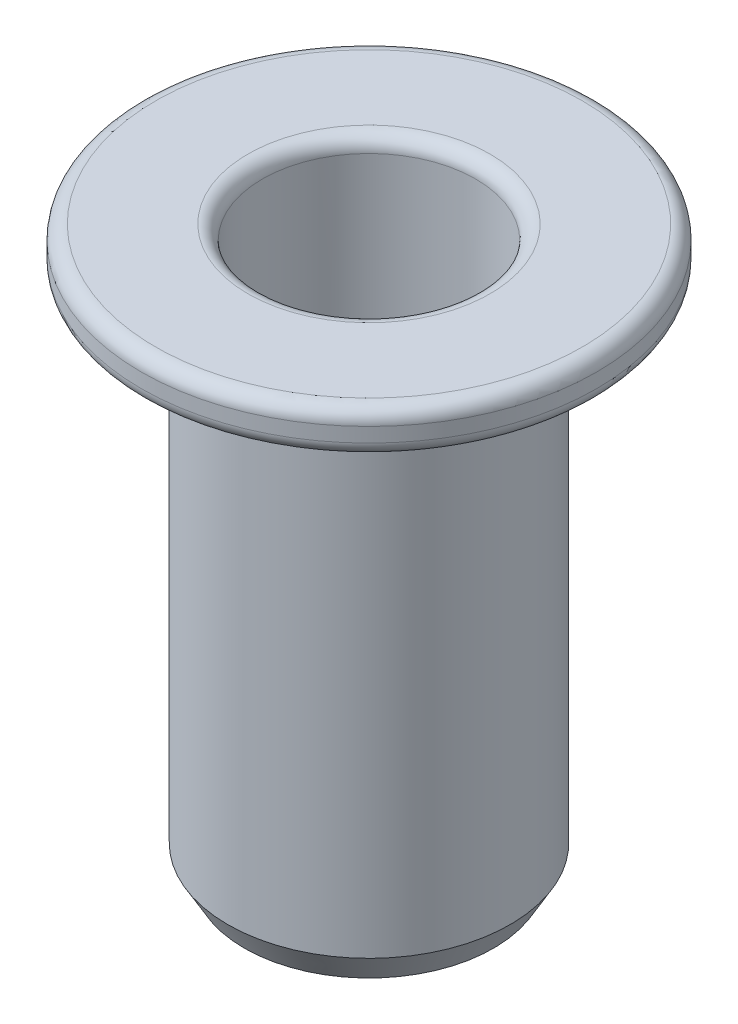
ISO-10303-21;
HEADER;
FILE_DESCRIPTION(('STEP AP214'),'2;1');
FILE_NAME('part.step','',(''),(''),'','','');
FILE_SCHEMA(('AUTOMOTIVE_DESIGN { 1 0 10303 214 1 1 1 1 }'));
ENDSEC;
DATA;
#1=APPLICATION_CONTEXT('core data for automotive mechanical design processes');
#2=APPLICATION_PROTOCOL_DEFINITION('international standard','automotive_design',2000,#1);
#3=PRODUCT_CONTEXT('',#1,'mechanical');
#4=PRODUCT('Part','Part','',(#3));
#5=PRODUCT_RELATED_PRODUCT_CATEGORY('part','',(#4));
#6=PRODUCT_DEFINITION_FORMATION('','',#4);
#7=PRODUCT_DEFINITION_CONTEXT('part definition',#1,'design');
#8=PRODUCT_DEFINITION('design','',#6,#7);
#9=PRODUCT_DEFINITION_SHAPE('','',#8);
#10=(LENGTH_UNIT() NAMED_UNIT(*) SI_UNIT(.MILLI.,.METRE.));
#11=(NAMED_UNIT(*) PLANE_ANGLE_UNIT() SI_UNIT($,.RADIAN.));
#12=(NAMED_UNIT(*) SI_UNIT($,.STERADIAN.) SOLID_ANGLE_UNIT());
#13=UNCERTAINTY_MEASURE_WITH_UNIT(LENGTH_MEASURE(1.E-05),#10,'distance_accuracy_value','');
#14=(GEOMETRIC_REPRESENTATION_CONTEXT(3) GLOBAL_UNCERTAINTY_ASSIGNED_CONTEXT((#13)) GLOBAL_UNIT_ASSIGNED_CONTEXT((#10,
#11,#12)) REPRESENTATION_CONTEXT('',''));
#15=CARTESIAN_POINT('',(0.,0.,0.));
#16=DIRECTION('',(0.,0.,1.));
#17=DIRECTION('',(1.,0.,0.));
#18=AXIS2_PLACEMENT_3D('',#15,#16,#17);
#19=CARTESIAN_POINT('',(3.95,0.,0.));
#20=DIRECTION('',(0.,-1.,0.));
#21=DIRECTION('',(0.,0.,-1.));
#22=AXIS2_PLACEMENT_3D('',#19,#20,#21);
#23=PLANE('',#22);
#24=CARTESIAN_POINT('',(0.,0.,0.));
#25=DIRECTION('',(0.,-1.,0.));
#26=DIRECTION('',(0.,0.,-1.));
#27=AXIS2_PLACEMENT_3D('',#24,#25,#26);
#28=CIRCLE('',#27,3.7);
#29=CARTESIAN_POINT('',(0.,0.,-3.7));
#30=VERTEX_POINT('',#29);
#31=EDGE_CURVE('E55',#30,#30,#28,.F.);
#32=ORIENTED_EDGE('',*,*,#31,.T.);
#33=EDGE_LOOP('',(#32));
#34=FACE_BOUND('',#33,.T.);
#35=CARTESIAN_POINT('',(0.,0.,0.));
#36=DIRECTION('',(0.,-1.,0.));
#37=DIRECTION('',(0.,0.,-1.));
#38=AXIS2_PLACEMENT_3D('',#35,#36,#37);
#39=CIRCLE('',#38,2.1);
#40=CARTESIAN_POINT('',(0.,0.,-2.1));
#41=VERTEX_POINT('',#40);
#42=EDGE_CURVE('E58',#41,#41,#39,.T.);
#43=ORIENTED_EDGE('',*,*,#42,.T.);
#44=EDGE_LOOP('',(#43));
#45=FACE_BOUND('',#44,.T.);
#46=ADVANCED_FACE('F32',(#34,#45),#23,.F.);
#47=CARTESIAN_POINT('',(0.,0.,0.));
#48=DIRECTION('',(0.,1.,0.));
#49=DIRECTION('',(0.,0.,1.));
#50=AXIS2_PLACEMENT_3D('',#47,#48,#49);
#51=CYLINDRICAL_SURFACE('',#50,1.85);
#52=CARTESIAN_POINT('',(0.,-0.25,0.));
#53=DIRECTION('',(0.,-1.,0.));
#54=DIRECTION('',(0.,0.,-1.));
#55=AXIS2_PLACEMENT_3D('',#52,#53,#54);
#56=CIRCLE('',#55,1.85);
#57=CARTESIAN_POINT('',(0.,-0.25,-1.85));
#58=VERTEX_POINT('',#57);
#59=EDGE_CURVE('E52',#58,#58,#56,.F.);
#60=ORIENTED_EDGE('',*,*,#59,.T.);
#61=EDGE_LOOP('',(#60));
#62=FACE_BOUND('',#61,.T.);
#63=CARTESIAN_POINT('',(0.,-4.5,0.));
#64=DIRECTION('',(0.,1.,0.));
#65=DIRECTION('',(0.,0.,1.));
#66=AXIS2_PLACEMENT_3D('',#63,#64,#65);
#67=CIRCLE('',#66,1.85);
#68=CARTESIAN_POINT('',(0.,-4.5,1.85));
#69=VERTEX_POINT('',#68);
#70=EDGE_CURVE('E70',#69,#69,#67,.T.);
#71=ORIENTED_EDGE('',*,*,#70,.F.);
#72=EDGE_LOOP('',(#71));
#73=FACE_BOUND('',#72,.T.);
#74=ADVANCED_FACE('F97',(#62,#73),#51,.F.);
#75=CARTESIAN_POINT('',(1.85,-4.5,0.));
#76=DIRECTION('',(0.,-1.,0.));
#77=DIRECTION('',(0.,0.,-1.));
#78=AXIS2_PLACEMENT_3D('',#75,#76,#77);
#79=PLANE('',#78);
#80=CARTESIAN_POINT('',(0.,-4.5,0.));
#81=DIRECTION('',(0.,1.,0.));
#82=DIRECTION('',(0.,0.,1.));
#83=AXIS2_PLACEMENT_3D('',#80,#81,#82);
#84=CIRCLE('',#83,1.5);
#85=CARTESIAN_POINT('',(0.,-4.5,1.5));
#86=VERTEX_POINT('',#85);
#87=EDGE_CURVE('E73',#86,#86,#84,.T.);
#88=ORIENTED_EDGE('',*,*,#87,.F.);
#89=EDGE_LOOP('',(#88));
#90=FACE_BOUND('',#89,.T.);
#91=ORIENTED_EDGE('',*,*,#70,.T.);
#92=EDGE_LOOP('',(#91));
#93=FACE_BOUND('',#92,.T.);
#94=ADVANCED_FACE('F103',(#90,#93),#79,.F.);
#95=CARTESIAN_POINT('',(0.,0.,0.));
#96=DIRECTION('',(0.,1.,0.));
#97=DIRECTION('',(0.,0.,1.));
#98=AXIS2_PLACEMENT_3D('',#95,#96,#97);
#99=CYLINDRICAL_SURFACE('',#98,1.5);
#100=CARTESIAN_POINT('',(0.,-9.3,0.));
#101=DIRECTION('',(0.,1.,0.));
#102=DIRECTION('',(0.,0.,1.));
#103=AXIS2_PLACEMENT_3D('',#100,#101,#102);
#104=CIRCLE('',#103,1.5);
#105=CARTESIAN_POINT('',(0.,-9.3,1.5));
#106=VERTEX_POINT('',#105);
#107=EDGE_CURVE('E10',#106,#106,#104,.F.);
#108=ORIENTED_EDGE('',*,*,#107,.T.);
#109=EDGE_LOOP('',(#108));
#110=FACE_BOUND('',#109,.T.);
#111=ORIENTED_EDGE('',*,*,#87,.T.);
#112=EDGE_LOOP('',(#111));
#113=FACE_BOUND('',#112,.T.);
#114=ADVANCED_FACE('F94',(#110,#113),#99,.F.);
#115=CARTESIAN_POINT('',(1.5,-9.8,0.));
#116=DIRECTION('',(0.,1.,0.));
#117=DIRECTION('',(0.,0.,1.));
#118=AXIS2_PLACEMENT_3D('',#115,#116,#117);
#119=PLANE('',#118);
#120=CARTESIAN_POINT('',(0.,-9.8,0.));
#121=DIRECTION('',(0.,1.,0.));
#122=DIRECTION('',(0.,0.,1.));
#123=AXIS2_PLACEMENT_3D('',#120,#121,#122);
#124=CIRCLE('',#123,2.);
#125=CARTESIAN_POINT('',(0.,-9.8,2.));
#126=VERTEX_POINT('',#125);
#127=EDGE_CURVE('E39',#126,#126,#124,.T.);
#128=ORIENTED_EDGE('',*,*,#127,.T.);
#129=EDGE_LOOP('',(#128));
#130=FACE_BOUND('',#129,.T.);
#131=CARTESIAN_POINT('',(0.,-9.8,0.));
#132=DIRECTION('',(0.,1.,0.));
#133=DIRECTION('',(0.,0.,1.));
#134=AXIS2_PLACEMENT_3D('',#131,#132,#133);
#135=CIRCLE('',#134,2.16132486540519);
#136=CARTESIAN_POINT('',(0.,-9.8,2.16132486540519));
#137=VERTEX_POINT('',#136);
#138=EDGE_CURVE('E43',#137,#137,#135,.F.);
#139=ORIENTED_EDGE('',*,*,#138,.T.);
#140=EDGE_LOOP('',(#139));
#141=FACE_BOUND('',#140,.T.);
#142=ADVANCED_FACE('F84',(#130,#141),#119,.F.);
#143=CARTESIAN_POINT('',(0.,0.,0.));
#144=DIRECTION('',(0.,1.,0.));
#145=DIRECTION('',(0.,0.,1.));
#146=AXIS2_PLACEMENT_3D('',#143,#144,#145);
#147=CYLINDRICAL_SURFACE('',#146,2.45);
#148=CARTESIAN_POINT('',(0.,-9.3,0.));
#149=DIRECTION('',(0.,1.,0.));
#150=DIRECTION('',(0.,0.,1.));
#151=AXIS2_PLACEMENT_3D('',#148,#149,#150);
#152=CIRCLE('',#151,2.45);
#153=CARTESIAN_POINT('',(0.,-9.3,2.45));
#154=VERTEX_POINT('',#153);
#155=EDGE_CURVE('E47',#154,#154,#152,.T.);
#156=ORIENTED_EDGE('',*,*,#155,.T.);
#157=EDGE_LOOP('',(#156));
#158=FACE_BOUND('',#157,.T.);
#159=CARTESIAN_POINT('',(0.,-0.75,0.));
#160=DIRECTION('',(0.,1.,0.));
#161=DIRECTION('',(0.,0.,1.));
#162=AXIS2_PLACEMENT_3D('',#159,#160,#161);
#163=CIRCLE('',#162,2.45);
#164=CARTESIAN_POINT('',(0.,-0.75,2.45));
#165=VERTEX_POINT('',#164);
#166=EDGE_CURVE('E76',#165,#165,#163,.T.);
#167=ORIENTED_EDGE('',*,*,#166,.F.);
#168=EDGE_LOOP('',(#167));
#169=FACE_BOUND('',#168,.T.);
#170=ADVANCED_FACE('F82',(#158,#169),#147,.T.);
#171=CARTESIAN_POINT('',(2.45,-0.75,0.));
#172=DIRECTION('',(0.,1.,0.));
#173=DIRECTION('',(0.,0.,1.));
#174=AXIS2_PLACEMENT_3D('',#171,#172,#173);
#175=PLANE('',#174);
#176=CARTESIAN_POINT('',(0.,-0.75,0.));
#177=DIRECTION('',(0.,1.,0.));
#178=DIRECTION('',(0.,0.,1.));
#179=AXIS2_PLACEMENT_3D('',#176,#177,#178);
#180=CIRCLE('',#179,3.7);
#181=CARTESIAN_POINT('',(0.,-0.75,3.7));
#182=VERTEX_POINT('',#181);
#183=EDGE_CURVE('E61',#182,#182,#180,.F.);
#184=ORIENTED_EDGE('',*,*,#183,.T.);
#185=EDGE_LOOP('',(#184));
#186=FACE_BOUND('',#185,.T.);
#187=ORIENTED_EDGE('',*,*,#166,.T.);
#188=EDGE_LOOP('',(#187));
#189=FACE_BOUND('',#188,.T.);
#190=ADVANCED_FACE('F80',(#186,#189),#175,.F.);
#191=CARTESIAN_POINT('',(0.,0.,0.));
#192=DIRECTION('',(0.,1.,0.));
#193=DIRECTION('',(0.,0.,1.));
#194=AXIS2_PLACEMENT_3D('',#191,#192,#193);
#195=CYLINDRICAL_SURFACE('',#194,3.95);
#196=CARTESIAN_POINT('',(0.,-0.5,0.));
#197=DIRECTION('',(0.,1.,0.));
#198=DIRECTION('',(0.,0.,1.));
#199=AXIS2_PLACEMENT_3D('',#196,#197,#198);
#200=CIRCLE('',#199,3.95);
#201=CARTESIAN_POINT('',(0.,-0.5,3.95));
#202=VERTEX_POINT('',#201);
#203=EDGE_CURVE('E64',#202,#202,#200,.T.);
#204=ORIENTED_EDGE('',*,*,#203,.T.);
#205=EDGE_LOOP('',(#204));
#206=FACE_BOUND('',#205,.T.);
#207=CARTESIAN_POINT('',(0.,-0.25,0.));
#208=DIRECTION('',(0.,-1.,0.));
#209=DIRECTION('',(0.,0.,-1.));
#210=AXIS2_PLACEMENT_3D('',#207,#208,#209);
#211=CIRCLE('',#210,3.95);
#212=CARTESIAN_POINT('',(0.,-0.25,-3.95));
#213=VERTEX_POINT('',#212);
#214=EDGE_CURVE('E67',#213,#213,#211,.T.);
#215=ORIENTED_EDGE('',*,*,#214,.T.);
#216=EDGE_LOOP('',(#215));
#217=FACE_BOUND('',#216,.T.);
#218=ADVANCED_FACE('F91',(#206,#217),#195,.T.);
#219=CARTESIAN_POINT('',(0.,-0.5,0.));
#220=DIRECTION('',(0.,1.,0.));
#221=DIRECTION('',(0.,0.,1.));
#222=AXIS2_PLACEMENT_3D('',#219,#220,#221);
#223=TOROIDAL_SURFACE('',#222,3.7,0.25);
#224=ORIENTED_EDGE('',*,*,#183,.F.);
#225=EDGE_LOOP('',(#224));
#226=FACE_BOUND('',#225,.T.);
#227=ORIENTED_EDGE('',*,*,#203,.F.);
#228=EDGE_LOOP('',(#227));
#229=FACE_BOUND('',#228,.T.);
#230=ADVANCED_FACE('F109',(#226,#229),#223,.T.);
#231=CARTESIAN_POINT('',(0.,-0.25,0.));
#232=DIRECTION('',(0.,-1.,0.));
#233=DIRECTION('',(0.,0.,-1.));
#234=AXIS2_PLACEMENT_3D('',#231,#232,#233);
#235=TOROIDAL_SURFACE('',#234,3.7,0.25);
#236=ORIENTED_EDGE('',*,*,#214,.F.);
#237=EDGE_LOOP('',(#236));
#238=FACE_BOUND('',#237,.T.);
#239=ORIENTED_EDGE('',*,*,#31,.F.);
#240=EDGE_LOOP('',(#239));
#241=FACE_BOUND('',#240,.T.);
#242=ADVANCED_FACE('F112',(#238,#241),#235,.T.);
#243=CARTESIAN_POINT('',(0.,-0.25,0.));
#244=DIRECTION('',(0.,-1.,0.));
#245=DIRECTION('',(0.,0.,-1.));
#246=AXIS2_PLACEMENT_3D('',#243,#244,#245);
#247=TOROIDAL_SURFACE('',#246,2.1,0.25);
#248=ORIENTED_EDGE('',*,*,#42,.F.);
#249=EDGE_LOOP('',(#248));
#250=FACE_BOUND('',#249,.T.);
#251=ORIENTED_EDGE('',*,*,#59,.F.);
#252=EDGE_LOOP('',(#251));
#253=FACE_BOUND('',#252,.T.);
#254=ADVANCED_FACE('F116',(#250,#253),#247,.T.);
#255=CARTESIAN_POINT('',(0.,-9.3,0.));
#256=DIRECTION('',(0.,1.,0.));
#257=DIRECTION('',(0.,0.,1.));
#258=AXIS2_PLACEMENT_3D('',#255,#256,#257);
#259=CONICAL_SURFACE('',#258,2.45,0.523598775598298);
#260=ORIENTED_EDGE('',*,*,#138,.F.);
#261=EDGE_LOOP('',(#260));
#262=FACE_BOUND('',#261,.T.);
#263=ORIENTED_EDGE('',*,*,#155,.F.);
#264=EDGE_LOOP('',(#263));
#265=FACE_BOUND('',#264,.T.);
#266=ADVANCED_FACE('F119',(#262,#265),#259,.T.);
#267=CARTESIAN_POINT('',(0.,-9.8,0.));
#268=DIRECTION('',(0.,-1.,0.));
#269=DIRECTION('',(0.,0.,-1.));
#270=AXIS2_PLACEMENT_3D('',#267,#268,#269);
#271=CONICAL_SURFACE('',#270,2.,0.785398163397447);
#272=ORIENTED_EDGE('',*,*,#107,.F.);
#273=EDGE_LOOP('',(#272));
#274=FACE_BOUND('',#273,.T.);
#275=ORIENTED_EDGE('',*,*,#127,.F.);
#276=EDGE_LOOP('',(#275));
#277=FACE_BOUND('',#276,.T.);
#278=ADVANCED_FACE('F34',(#274,#277),#271,.F.);
#279=CLOSED_SHELL('',(#46,#74,#94,#114,#142,#170,#190,#218,#230,#242,#254,#266,#278));
#280=MANIFOLD_SOLID_BREP('B2',#279);
#281=ADVANCED_BREP_SHAPE_REPRESENTATION('',(#18,#280),#14);
#282=SHAPE_DEFINITION_REPRESENTATION(#9,#281);
ENDSEC;
END-ISO-10303-21;
